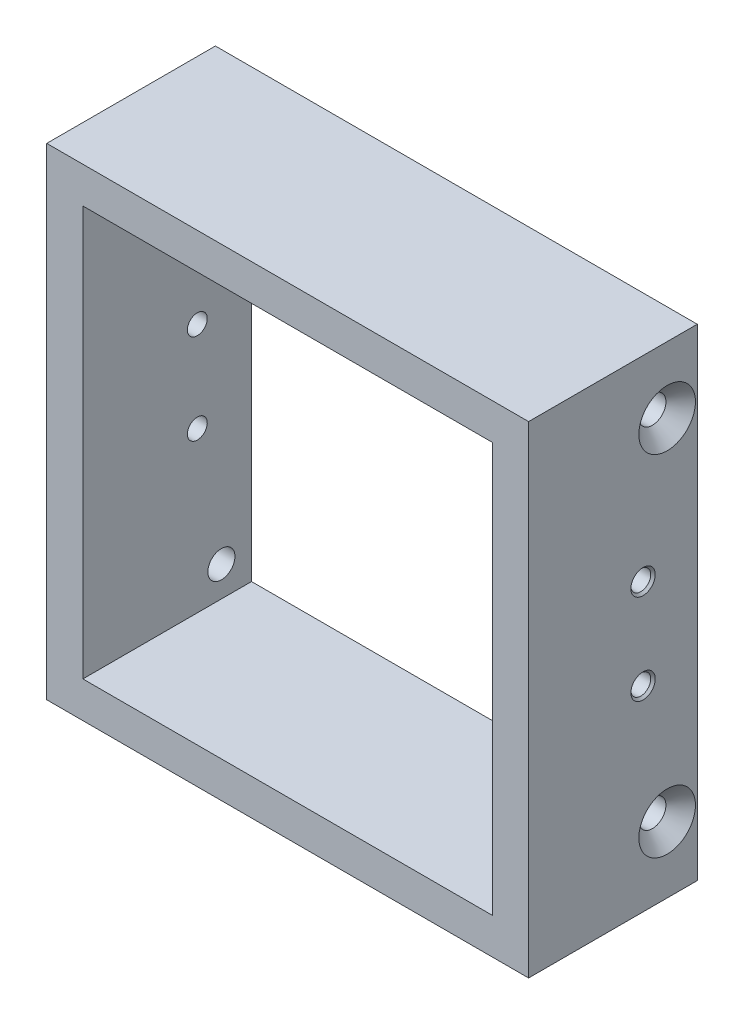
ISO-10303-21;
HEADER;
FILE_DESCRIPTION(('STEP AP214'),'2;1');
FILE_NAME('part.step','',(''),(''),'','','');
FILE_SCHEMA(('AUTOMOTIVE_DESIGN { 1 0 10303 214 1 1 1 1 }'));
ENDSEC;
DATA;
#1=APPLICATION_CONTEXT('core data for automotive mechanical design processes');
#2=APPLICATION_PROTOCOL_DEFINITION('international standard','automotive_design',2000,#1);
#3=PRODUCT_CONTEXT('',#1,'mechanical');
#4=PRODUCT('Part','Part','',(#3));
#5=PRODUCT_RELATED_PRODUCT_CATEGORY('part','',(#4));
#6=PRODUCT_DEFINITION_FORMATION('','',#4);
#7=PRODUCT_DEFINITION_CONTEXT('part definition',#1,'design');
#8=PRODUCT_DEFINITION('design','',#6,#7);
#9=PRODUCT_DEFINITION_SHAPE('','',#8);
#10=(LENGTH_UNIT() NAMED_UNIT(*) SI_UNIT(.MILLI.,.METRE.));
#11=(NAMED_UNIT(*) PLANE_ANGLE_UNIT() SI_UNIT($,.RADIAN.));
#12=(NAMED_UNIT(*) SI_UNIT($,.STERADIAN.) SOLID_ANGLE_UNIT());
#13=UNCERTAINTY_MEASURE_WITH_UNIT(LENGTH_MEASURE(1.E-05),#10,'distance_accuracy_value','');
#14=(GEOMETRIC_REPRESENTATION_CONTEXT(3) GLOBAL_UNCERTAINTY_ASSIGNED_CONTEXT((#13)) GLOBAL_UNIT_ASSIGNED_CONTEXT((#10,
#11,#12)) REPRESENTATION_CONTEXT('',''));
#15=CARTESIAN_POINT('',(0.,0.,0.));
#16=DIRECTION('',(0.,0.,1.));
#17=DIRECTION('',(1.,0.,0.));
#18=AXIS2_PLACEMENT_3D('',#15,#16,#17);
#19=CARTESIAN_POINT('',(40.,40.,28.));
#20=DIRECTION('',(-1.,0.,0.));
#21=DIRECTION('',(0.,0.,1.));
#22=AXIS2_PLACEMENT_3D('',#19,#20,#21);
#23=PLANE('',#22);
#24=CARTESIAN_POINT('',(40.,7.5,9.00000000000001));
#25=DIRECTION('',(1.,0.,0.));
#26=DIRECTION('',(0.,0.,-1.));
#27=AXIS2_PLACEMENT_3D('',#24,#25,#26);
#28=CIRCLE('',#27,2.025);
#29=CARTESIAN_POINT('',(40.,7.5,6.97500000000001));
#30=VERTEX_POINT('',#29);
#31=EDGE_CURVE('E202',#30,#30,#28,.T.);
#32=ORIENTED_EDGE('',*,*,#31,.F.);
#33=EDGE_LOOP('',(#32));
#34=FACE_BOUND('',#33,.T.);
#35=CARTESIAN_POINT('',(40.,-7.5,9.00000000000001));
#36=DIRECTION('',(1.,0.,0.));
#37=DIRECTION('',(0.,0.,-1.));
#38=AXIS2_PLACEMENT_3D('',#35,#36,#37);
#39=CIRCLE('',#38,2.025);
#40=CARTESIAN_POINT('',(40.,-7.5,6.975));
#41=VERTEX_POINT('',#40);
#42=EDGE_CURVE('E205',#41,#41,#39,.T.);
#43=ORIENTED_EDGE('',*,*,#42,.F.);
#44=EDGE_LOOP('',(#43));
#45=FACE_BOUND('',#44,.T.);
#46=DIRECTION('',(0.,1.,0.));
#47=VECTOR('',#46,1.);
#48=CARTESIAN_POINT('',(40.,40.,0.));
#49=LINE('',#48,#47);
#50=CARTESIAN_POINT('',(40.,-40.,0.));
#51=VERTEX_POINT('',#50);
#52=CARTESIAN_POINT('',(40.,40.,0.));
#53=VERTEX_POINT('',#52);
#54=EDGE_CURVE('E116',#51,#53,#49,.T.);
#55=ORIENTED_EDGE('',*,*,#54,.T.);
#56=DIRECTION('',(0.,0.,-1.));
#57=VECTOR('',#56,1.);
#58=CARTESIAN_POINT('',(40.,40.,28.));
#59=LINE('',#58,#57);
#60=CARTESIAN_POINT('',(40.,40.,28.));
#61=VERTEX_POINT('',#60);
#62=EDGE_CURVE('E11',#61,#53,#59,.T.);
#63=ORIENTED_EDGE('',*,*,#62,.F.);
#64=DIRECTION('',(0.,1.,0.));
#65=VECTOR('',#64,1.);
#66=CARTESIAN_POINT('',(40.,40.,28.));
#67=LINE('',#66,#65);
#68=CARTESIAN_POINT('',(40.,-40.,28.));
#69=VERTEX_POINT('',#68);
#70=EDGE_CURVE('E139',#69,#61,#67,.T.);
#71=ORIENTED_EDGE('',*,*,#70,.F.);
#72=DIRECTION('',(0.,0.,-1.));
#73=VECTOR('',#72,1.);
#74=CARTESIAN_POINT('',(40.,-40.,28.));
#75=LINE('',#74,#73);
#76=EDGE_CURVE('E149',#69,#51,#75,.T.);
#77=ORIENTED_EDGE('',*,*,#76,.T.);
#78=EDGE_LOOP('',(#55,#63,#71,#77));
#79=FACE_BOUND('',#78,.T.);
#80=CARTESIAN_POINT('',(40.,-29.,5.));
#81=DIRECTION('',(1.,0.,0.));
#82=DIRECTION('',(0.,0.,-1.));
#83=AXIS2_PLACEMENT_3D('',#80,#81,#82);
#84=CIRCLE('',#83,4.7);
#85=CARTESIAN_POINT('',(40.,-29.,0.300000000000001));
#86=VERTEX_POINT('',#85);
#87=EDGE_CURVE('E247',#86,#86,#84,.T.);
#88=ORIENTED_EDGE('',*,*,#87,.F.);
#89=EDGE_LOOP('',(#88));
#90=FACE_BOUND('',#89,.T.);
#91=CARTESIAN_POINT('',(40.,29.,5.));
#92=DIRECTION('',(1.,0.,0.));
#93=DIRECTION('',(0.,0.,-1.));
#94=AXIS2_PLACEMENT_3D('',#91,#92,#93);
#95=CIRCLE('',#94,4.7);
#96=CARTESIAN_POINT('',(40.,29.,0.299999999999997));
#97=VERTEX_POINT('',#96);
#98=EDGE_CURVE('E238',#97,#97,#95,.T.);
#99=ORIENTED_EDGE('',*,*,#98,.F.);
#100=EDGE_LOOP('',(#99));
#101=FACE_BOUND('',#100,.T.);
#102=ADVANCED_FACE('F36',(#34,#45,#79,#90,#101),#23,.F.);
#103=CARTESIAN_POINT('',(-40.,40.,28.));
#104=DIRECTION('',(1.,0.,0.));
#105=DIRECTION('',(0.,1.,0.));
#106=AXIS2_PLACEMENT_3D('',#103,#104,#105);
#107=PLANE('',#106);
#108=CARTESIAN_POINT('',(-40.,7.5,9.00000000000001));
#109=DIRECTION('',(-1.,0.,0.));
#110=DIRECTION('',(0.,0.,1.));
#111=AXIS2_PLACEMENT_3D('',#108,#109,#110);
#112=CIRCLE('',#111,2.025);
#113=CARTESIAN_POINT('',(-40.,7.5,11.025));
#114=VERTEX_POINT('',#113);
#115=EDGE_CURVE('E220',#114,#114,#112,.T.);
#116=ORIENTED_EDGE('',*,*,#115,.F.);
#117=EDGE_LOOP('',(#116));
#118=FACE_BOUND('',#117,.T.);
#119=CARTESIAN_POINT('',(-40.,-7.5,9.00000000000001));
#120=DIRECTION('',(-1.,0.,0.));
#121=DIRECTION('',(0.,0.,1.));
#122=AXIS2_PLACEMENT_3D('',#119,#120,#121);
#123=CIRCLE('',#122,2.025);
#124=CARTESIAN_POINT('',(-40.,-7.5,11.025));
#125=VERTEX_POINT('',#124);
#126=EDGE_CURVE('E229',#125,#125,#123,.T.);
#127=ORIENTED_EDGE('',*,*,#126,.F.);
#128=EDGE_LOOP('',(#127));
#129=FACE_BOUND('',#128,.T.);
#130=CARTESIAN_POINT('',(-40.,29.,5.));
#131=DIRECTION('',(-1.,0.,0.));
#132=DIRECTION('',(0.,0.,1.));
#133=AXIS2_PLACEMENT_3D('',#130,#131,#132);
#134=CIRCLE('',#133,4.7);
#135=CARTESIAN_POINT('',(-40.,29.,9.7));
#136=VERTEX_POINT('',#135);
#137=EDGE_CURVE('E265',#136,#136,#134,.T.);
#138=ORIENTED_EDGE('',*,*,#137,.F.);
#139=EDGE_LOOP('',(#138));
#140=FACE_BOUND('',#139,.T.);
#141=DIRECTION('',(0.,-1.,0.));
#142=VECTOR('',#141,1.);
#143=CARTESIAN_POINT('',(-40.,40.,0.));
#144=LINE('',#143,#142);
#145=CARTESIAN_POINT('',(-40.,40.,0.));
#146=VERTEX_POINT('',#145);
#147=CARTESIAN_POINT('',(-40.,-40.,0.));
#148=VERTEX_POINT('',#147);
#149=EDGE_CURVE('E154',#146,#148,#144,.T.);
#150=ORIENTED_EDGE('',*,*,#149,.T.);
#151=DIRECTION('',(0.,0.,-1.));
#152=VECTOR('',#151,1.);
#153=CARTESIAN_POINT('',(-40.,-40.,28.));
#154=LINE('',#153,#152);
#155=CARTESIAN_POINT('',(-40.,-40.,28.));
#156=VERTEX_POINT('',#155);
#157=EDGE_CURVE('E159',#156,#148,#154,.T.);
#158=ORIENTED_EDGE('',*,*,#157,.F.);
#159=DIRECTION('',(0.,-1.,0.));
#160=VECTOR('',#159,1.);
#161=CARTESIAN_POINT('',(-40.,40.,28.));
#162=LINE('',#161,#160);
#163=CARTESIAN_POINT('',(-40.,40.,28.));
#164=VERTEX_POINT('',#163);
#165=EDGE_CURVE('E145',#164,#156,#162,.T.);
#166=ORIENTED_EDGE('',*,*,#165,.F.);
#167=DIRECTION('',(0.,0.,-1.));
#168=VECTOR('',#167,1.);
#169=CARTESIAN_POINT('',(-40.,40.,28.));
#170=LINE('',#169,#168);
#171=EDGE_CURVE('E43',#164,#146,#170,.T.);
#172=ORIENTED_EDGE('',*,*,#171,.T.);
#173=EDGE_LOOP('',(#150,#158,#166,#172));
#174=FACE_BOUND('',#173,.T.);
#175=CARTESIAN_POINT('',(-40.,-29.,5.));
#176=DIRECTION('',(-1.,0.,0.));
#177=DIRECTION('',(0.,0.,1.));
#178=AXIS2_PLACEMENT_3D('',#175,#176,#177);
#179=CIRCLE('',#178,4.7);
#180=CARTESIAN_POINT('',(-40.,-29.,9.7));
#181=VERTEX_POINT('',#180);
#182=EDGE_CURVE('E256',#181,#181,#179,.T.);
#183=ORIENTED_EDGE('',*,*,#182,.F.);
#184=EDGE_LOOP('',(#183));
#185=FACE_BOUND('',#184,.T.);
#186=ADVANCED_FACE('F166',(#118,#129,#140,#174,#185),#107,.F.);
#187=CARTESIAN_POINT('',(0.,0.,28.));
#188=DIRECTION('',(0.,0.,1.));
#189=DIRECTION('',(1.,0.,0.));
#190=AXIS2_PLACEMENT_3D('',#187,#188,#189);
#191=PLANE('',#190);
#192=ORIENTED_EDGE('',*,*,#70,.T.);
#193=DIRECTION('',(-1.,0.,0.));
#194=VECTOR('',#193,1.);
#195=CARTESIAN_POINT('',(-40.,40.,28.));
#196=LINE('',#195,#194);
#197=EDGE_CURVE('E142',#61,#164,#196,.T.);
#198=ORIENTED_EDGE('',*,*,#197,.T.);
#199=ORIENTED_EDGE('',*,*,#165,.T.);
#200=DIRECTION('',(1.,0.,0.));
#201=VECTOR('',#200,1.);
#202=CARTESIAN_POINT('',(-40.,-40.,28.));
#203=LINE('',#202,#201);
#204=EDGE_CURVE('E147',#156,#69,#203,.T.);
#205=ORIENTED_EDGE('',*,*,#204,.T.);
#206=EDGE_LOOP('',(#192,#198,#199,#205));
#207=FACE_BOUND('',#206,.T.);
#208=DIRECTION('',(-1.,0.,0.));
#209=VECTOR('',#208,1.);
#210=CARTESIAN_POINT('',(-34.,34.,28.));
#211=LINE('',#210,#209);
#212=CARTESIAN_POINT('',(34.,34.,28.));
#213=VERTEX_POINT('',#212);
#214=CARTESIAN_POINT('',(-34.,34.,28.));
#215=VERTEX_POINT('',#214);
#216=EDGE_CURVE('E108',#213,#215,#211,.T.);
#217=ORIENTED_EDGE('',*,*,#216,.F.);
#218=DIRECTION('',(0.,1.,0.));
#219=VECTOR('',#218,1.);
#220=CARTESIAN_POINT('',(34.,34.,28.));
#221=LINE('',#220,#219);
#222=CARTESIAN_POINT('',(34.,-34.,28.));
#223=VERTEX_POINT('',#222);
#224=EDGE_CURVE('E100',#223,#213,#221,.T.);
#225=ORIENTED_EDGE('',*,*,#224,.F.);
#226=DIRECTION('',(1.,0.,0.));
#227=VECTOR('',#226,1.);
#228=CARTESIAN_POINT('',(-34.,-34.,28.));
#229=LINE('',#228,#227);
#230=CARTESIAN_POINT('',(-34.,-34.,28.));
#231=VERTEX_POINT('',#230);
#232=EDGE_CURVE('E123',#231,#223,#229,.T.);
#233=ORIENTED_EDGE('',*,*,#232,.F.);
#234=DIRECTION('',(0.,-1.,0.));
#235=VECTOR('',#234,1.);
#236=CARTESIAN_POINT('',(-34.,34.,28.));
#237=LINE('',#236,#235);
#238=EDGE_CURVE('E121',#215,#231,#237,.T.);
#239=ORIENTED_EDGE('',*,*,#238,.F.);
#240=EDGE_LOOP('',(#217,#225,#233,#239));
#241=FACE_BOUND('',#240,.T.);
#242=ADVANCED_FACE('F120',(#207,#241),#191,.T.);
#243=CARTESIAN_POINT('',(0.,0.,0.));
#244=DIRECTION('',(0.,0.,1.));
#245=DIRECTION('',(1.,0.,0.));
#246=AXIS2_PLACEMENT_3D('',#243,#244,#245);
#247=PLANE('',#246);
#248=ORIENTED_EDGE('',*,*,#54,.F.);
#249=DIRECTION('',(1.,0.,0.));
#250=VECTOR('',#249,1.);
#251=CARTESIAN_POINT('',(-40.,-40.,0.));
#252=LINE('',#251,#250);
#253=EDGE_CURVE('E143',#148,#51,#252,.T.);
#254=ORIENTED_EDGE('',*,*,#253,.F.);
#255=ORIENTED_EDGE('',*,*,#149,.F.);
#256=DIRECTION('',(-1.,0.,0.));
#257=VECTOR('',#256,1.);
#258=CARTESIAN_POINT('',(-40.,40.,0.));
#259=LINE('',#258,#257);
#260=EDGE_CURVE('E152',#53,#146,#259,.T.);
#261=ORIENTED_EDGE('',*,*,#260,.F.);
#262=EDGE_LOOP('',(#248,#254,#255,#261));
#263=FACE_BOUND('',#262,.T.);
#264=DIRECTION('',(0.,1.,0.));
#265=VECTOR('',#264,1.);
#266=CARTESIAN_POINT('',(34.,34.,0.));
#267=LINE('',#266,#265);
#268=CARTESIAN_POINT('',(34.,-34.,0.));
#269=VERTEX_POINT('',#268);
#270=CARTESIAN_POINT('',(34.,34.,0.));
#271=VERTEX_POINT('',#270);
#272=EDGE_CURVE('E58',#269,#271,#267,.T.);
#273=ORIENTED_EDGE('',*,*,#272,.T.);
#274=DIRECTION('',(-1.,0.,0.));
#275=VECTOR('',#274,1.);
#276=CARTESIAN_POINT('',(-34.,34.,0.));
#277=LINE('',#276,#275);
#278=CARTESIAN_POINT('',(-34.,34.,0.));
#279=VERTEX_POINT('',#278);
#280=EDGE_CURVE('E115',#271,#279,#277,.T.);
#281=ORIENTED_EDGE('',*,*,#280,.T.);
#282=DIRECTION('',(0.,-1.,0.));
#283=VECTOR('',#282,1.);
#284=CARTESIAN_POINT('',(-34.,34.,0.));
#285=LINE('',#284,#283);
#286=CARTESIAN_POINT('',(-34.,-34.,0.));
#287=VERTEX_POINT('',#286);
#288=EDGE_CURVE('E131',#279,#287,#285,.T.);
#289=ORIENTED_EDGE('',*,*,#288,.T.);
#290=DIRECTION('',(1.,0.,0.));
#291=VECTOR('',#290,1.);
#292=CARTESIAN_POINT('',(-34.,-34.,0.));
#293=LINE('',#292,#291);
#294=EDGE_CURVE('E109',#287,#269,#293,.T.);
#295=ORIENTED_EDGE('',*,*,#294,.T.);
#296=EDGE_LOOP('',(#273,#281,#289,#295));
#297=FACE_BOUND('',#296,.T.);
#298=ADVANCED_FACE('F173',(#263,#297),#247,.F.);
#299=CARTESIAN_POINT('',(-40.,40.,28.));
#300=DIRECTION('',(0.,-1.,0.));
#301=DIRECTION('',(0.,0.,-1.));
#302=AXIS2_PLACEMENT_3D('',#299,#300,#301);
#303=PLANE('',#302);
#304=ORIENTED_EDGE('',*,*,#260,.T.);
#305=ORIENTED_EDGE('',*,*,#171,.F.);
#306=ORIENTED_EDGE('',*,*,#197,.F.);
#307=ORIENTED_EDGE('',*,*,#62,.T.);
#308=EDGE_LOOP('',(#304,#305,#306,#307));
#309=FACE_BOUND('',#308,.T.);
#310=ADVANCED_FACE('F184',(#309),#303,.F.);
#311=CARTESIAN_POINT('',(-40.,-40.,28.));
#312=DIRECTION('',(0.,1.,0.));
#313=DIRECTION('',(0.,0.,1.));
#314=AXIS2_PLACEMENT_3D('',#311,#312,#313);
#315=PLANE('',#314);
#316=ORIENTED_EDGE('',*,*,#253,.T.);
#317=ORIENTED_EDGE('',*,*,#76,.F.);
#318=ORIENTED_EDGE('',*,*,#204,.F.);
#319=ORIENTED_EDGE('',*,*,#157,.T.);
#320=EDGE_LOOP('',(#316,#317,#318,#319));
#321=FACE_BOUND('',#320,.T.);
#322=ADVANCED_FACE('F177',(#321),#315,.F.);
#323=CARTESIAN_POINT('',(34.,34.,28.));
#324=DIRECTION('',(-1.,0.,0.));
#325=DIRECTION('',(0.,-1.,0.));
#326=AXIS2_PLACEMENT_3D('',#323,#324,#325);
#327=PLANE('',#326);
#328=CARTESIAN_POINT('',(34.,7.5,9.00000000000001));
#329=DIRECTION('',(-1.,0.,0.));
#330=DIRECTION('',(0.,-1.,0.));
#331=AXIS2_PLACEMENT_3D('',#328,#329,#330);
#332=CIRCLE('',#331,1.65);
#333=CARTESIAN_POINT('',(34.,5.85,9.00000000000001));
#334=VERTEX_POINT('',#333);
#335=EDGE_CURVE('E208',#334,#334,#332,.T.);
#336=ORIENTED_EDGE('',*,*,#335,.F.);
#337=EDGE_LOOP('',(#336));
#338=FACE_BOUND('',#337,.T.);
#339=CARTESIAN_POINT('',(34.,-7.5,9.00000000000001));
#340=DIRECTION('',(-1.,0.,0.));
#341=DIRECTION('',(0.,-1.,0.));
#342=AXIS2_PLACEMENT_3D('',#339,#340,#341);
#343=CIRCLE('',#342,1.65);
#344=CARTESIAN_POINT('',(34.,-9.15,9.00000000000001));
#345=VERTEX_POINT('',#344);
#346=EDGE_CURVE('E211',#345,#345,#343,.T.);
#347=ORIENTED_EDGE('',*,*,#346,.F.);
#348=EDGE_LOOP('',(#347));
#349=FACE_BOUND('',#348,.T.);
#350=CARTESIAN_POINT('',(34.,29.,5.));
#351=DIRECTION('',(-1.,0.,0.));
#352=DIRECTION('',(0.,-1.,0.));
#353=AXIS2_PLACEMENT_3D('',#350,#351,#352);
#354=CIRCLE('',#353,2.25);
#355=CARTESIAN_POINT('',(34.,26.75,5.));
#356=VERTEX_POINT('',#355);
#357=EDGE_CURVE('E244',#356,#356,#354,.T.);
#358=ORIENTED_EDGE('',*,*,#357,.F.);
#359=EDGE_LOOP('',(#358));
#360=FACE_BOUND('',#359,.T.);
#361=CARTESIAN_POINT('',(34.,-29.,5.));
#362=DIRECTION('',(-1.,0.,0.));
#363=DIRECTION('',(0.,-1.,0.));
#364=AXIS2_PLACEMENT_3D('',#361,#362,#363);
#365=CIRCLE('',#364,2.24999999999999);
#366=CARTESIAN_POINT('',(34.,-31.25,5.));
#367=VERTEX_POINT('',#366);
#368=EDGE_CURVE('E253',#367,#367,#365,.T.);
#369=ORIENTED_EDGE('',*,*,#368,.F.);
#370=EDGE_LOOP('',(#369));
#371=FACE_BOUND('',#370,.T.);
#372=ORIENTED_EDGE('',*,*,#272,.F.);
#373=DIRECTION('',(0.,0.,-1.));
#374=VECTOR('',#373,1.);
#375=CARTESIAN_POINT('',(34.,-34.,28.));
#376=LINE('',#375,#374);
#377=EDGE_CURVE('E104',#223,#269,#376,.T.);
#378=ORIENTED_EDGE('',*,*,#377,.F.);
#379=ORIENTED_EDGE('',*,*,#224,.T.);
#380=DIRECTION('',(0.,0.,-1.));
#381=VECTOR('',#380,1.);
#382=CARTESIAN_POINT('',(34.,34.,28.));
#383=LINE('',#382,#381);
#384=EDGE_CURVE('E103',#213,#271,#383,.T.);
#385=ORIENTED_EDGE('',*,*,#384,.T.);
#386=EDGE_LOOP('',(#372,#378,#379,#385));
#387=FACE_BOUND('',#386,.T.);
#388=ADVANCED_FACE('F102',(#338,#349,#360,#371,#387),#327,.T.);
#389=CARTESIAN_POINT('',(-34.,34.,28.));
#390=DIRECTION('',(0.,-1.,0.));
#391=DIRECTION('',(0.,0.,-1.));
#392=AXIS2_PLACEMENT_3D('',#389,#390,#391);
#393=PLANE('',#392);
#394=ORIENTED_EDGE('',*,*,#280,.F.);
#395=ORIENTED_EDGE('',*,*,#384,.F.);
#396=ORIENTED_EDGE('',*,*,#216,.T.);
#397=DIRECTION('',(0.,0.,-1.));
#398=VECTOR('',#397,1.);
#399=CARTESIAN_POINT('',(-34.,34.,28.));
#400=LINE('',#399,#398);
#401=EDGE_CURVE('E117',#215,#279,#400,.T.);
#402=ORIENTED_EDGE('',*,*,#401,.T.);
#403=EDGE_LOOP('',(#394,#395,#396,#402));
#404=FACE_BOUND('',#403,.T.);
#405=ADVANCED_FACE('F112',(#404),#393,.T.);
#406=CARTESIAN_POINT('',(-34.,34.,28.));
#407=DIRECTION('',(1.,0.,0.));
#408=DIRECTION('',(0.,1.,0.));
#409=AXIS2_PLACEMENT_3D('',#406,#407,#408);
#410=PLANE('',#409);
#411=CARTESIAN_POINT('',(-34.,7.5,9.00000000000001));
#412=DIRECTION('',(1.,0.,0.));
#413=DIRECTION('',(0.,1.,0.));
#414=AXIS2_PLACEMENT_3D('',#411,#412,#413);
#415=CIRCLE('',#414,1.64999999999999);
#416=CARTESIAN_POINT('',(-34.,9.14999999999999,9.00000000000001));
#417=VERTEX_POINT('',#416);
#418=EDGE_CURVE('E226',#417,#417,#415,.T.);
#419=ORIENTED_EDGE('',*,*,#418,.F.);
#420=EDGE_LOOP('',(#419));
#421=FACE_BOUND('',#420,.T.);
#422=CARTESIAN_POINT('',(-34.,-7.5,9.00000000000001));
#423=DIRECTION('',(1.,0.,0.));
#424=DIRECTION('',(0.,1.,0.));
#425=AXIS2_PLACEMENT_3D('',#422,#423,#424);
#426=CIRCLE('',#425,1.64999999999999);
#427=CARTESIAN_POINT('',(-34.,-5.85000000000001,9.00000000000001));
#428=VERTEX_POINT('',#427);
#429=EDGE_CURVE('E235',#428,#428,#426,.T.);
#430=ORIENTED_EDGE('',*,*,#429,.F.);
#431=EDGE_LOOP('',(#430));
#432=FACE_BOUND('',#431,.T.);
#433=CARTESIAN_POINT('',(-34.,-29.,5.));
#434=DIRECTION('',(1.,0.,0.));
#435=DIRECTION('',(0.,1.,0.));
#436=AXIS2_PLACEMENT_3D('',#433,#434,#435);
#437=CIRCLE('',#436,2.24999999999999);
#438=CARTESIAN_POINT('',(-34.,-26.75,5.));
#439=VERTEX_POINT('',#438);
#440=EDGE_CURVE('E262',#439,#439,#437,.T.);
#441=ORIENTED_EDGE('',*,*,#440,.F.);
#442=EDGE_LOOP('',(#441));
#443=FACE_BOUND('',#442,.T.);
#444=CARTESIAN_POINT('',(-34.,29.,5.));
#445=DIRECTION('',(1.,0.,0.));
#446=DIRECTION('',(0.,1.,0.));
#447=AXIS2_PLACEMENT_3D('',#444,#445,#446);
#448=CIRCLE('',#447,2.25);
#449=CARTESIAN_POINT('',(-34.,31.25,5.));
#450=VERTEX_POINT('',#449);
#451=EDGE_CURVE('E129',#450,#450,#448,.T.);
#452=ORIENTED_EDGE('',*,*,#451,.F.);
#453=EDGE_LOOP('',(#452));
#454=FACE_BOUND('',#453,.T.);
#455=ORIENTED_EDGE('',*,*,#288,.F.);
#456=ORIENTED_EDGE('',*,*,#401,.F.);
#457=ORIENTED_EDGE('',*,*,#238,.T.);
#458=DIRECTION('',(0.,0.,-1.));
#459=VECTOR('',#458,1.);
#460=CARTESIAN_POINT('',(-34.,-34.,28.));
#461=LINE('',#460,#459);
#462=EDGE_CURVE('E50',#231,#287,#461,.T.);
#463=ORIENTED_EDGE('',*,*,#462,.T.);
#464=EDGE_LOOP('',(#455,#456,#457,#463));
#465=FACE_BOUND('',#464,.T.);
#466=ADVANCED_FACE('F275',(#421,#432,#443,#454,#465),#410,.T.);
#467=CARTESIAN_POINT('',(-34.,-34.,28.));
#468=DIRECTION('',(0.,1.,0.));
#469=DIRECTION('',(0.,0.,1.));
#470=AXIS2_PLACEMENT_3D('',#467,#468,#469);
#471=PLANE('',#470);
#472=ORIENTED_EDGE('',*,*,#294,.F.);
#473=ORIENTED_EDGE('',*,*,#462,.F.);
#474=ORIENTED_EDGE('',*,*,#232,.T.);
#475=ORIENTED_EDGE('',*,*,#377,.T.);
#476=EDGE_LOOP('',(#472,#473,#474,#475));
#477=FACE_BOUND('',#476,.T.);
#478=ADVANCED_FACE('F278',(#477),#471,.T.);
#479=CARTESIAN_POINT('',(-40.,29.,5.));
#480=DIRECTION('',(-1.,0.,0.));
#481=DIRECTION('',(0.,0.,1.));
#482=AXIS2_PLACEMENT_3D('',#479,#480,#481);
#483=CYLINDRICAL_SURFACE('',#482,2.25);
#484=CARTESIAN_POINT('',(-37.55,29.,5.));
#485=DIRECTION('',(-1.,0.,0.));
#486=DIRECTION('',(0.,0.,1.));
#487=AXIS2_PLACEMENT_3D('',#484,#485,#486);
#488=CIRCLE('',#487,2.25);
#489=CARTESIAN_POINT('',(-37.55,29.,7.25));
#490=VERTEX_POINT('',#489);
#491=EDGE_CURVE('E268',#490,#490,#488,.T.);
#492=ORIENTED_EDGE('',*,*,#491,.T.);
#493=EDGE_LOOP('',(#492));
#494=FACE_BOUND('',#493,.T.);
#495=ORIENTED_EDGE('',*,*,#451,.T.);
#496=EDGE_LOOP('',(#495));
#497=FACE_BOUND('',#496,.T.);
#498=ADVANCED_FACE('F273',(#494,#497),#483,.F.);
#499=CARTESIAN_POINT('',(-40.,29.,5.));
#500=DIRECTION('',(-1.,0.,0.));
#501=DIRECTION('',(0.,0.,1.));
#502=AXIS2_PLACEMENT_3D('',#499,#500,#501);
#503=CONICAL_SURFACE('',#502,4.7,0.785398163397448);
#504=ORIENTED_EDGE('',*,*,#491,.F.);
#505=EDGE_LOOP('',(#504));
#506=FACE_BOUND('',#505,.T.);
#507=ORIENTED_EDGE('',*,*,#137,.T.);
#508=EDGE_LOOP('',(#507));
#509=FACE_BOUND('',#508,.T.);
#510=ADVANCED_FACE('F287',(#506,#509),#503,.F.);
#511=CARTESIAN_POINT('',(-40.,-29.,5.));
#512=DIRECTION('',(-1.,0.,0.));
#513=DIRECTION('',(0.,0.,1.));
#514=AXIS2_PLACEMENT_3D('',#511,#512,#513);
#515=CYLINDRICAL_SURFACE('',#514,2.24999999999999);
#516=CARTESIAN_POINT('',(-37.55,-29.,5.));
#517=DIRECTION('',(-1.,0.,0.));
#518=DIRECTION('',(0.,0.,1.));
#519=AXIS2_PLACEMENT_3D('',#516,#517,#518);
#520=CIRCLE('',#519,2.25);
#521=CARTESIAN_POINT('',(-37.55,-29.,7.25));
#522=VERTEX_POINT('',#521);
#523=EDGE_CURVE('E259',#522,#522,#520,.T.);
#524=ORIENTED_EDGE('',*,*,#523,.T.);
#525=EDGE_LOOP('',(#524));
#526=FACE_BOUND('',#525,.T.);
#527=ORIENTED_EDGE('',*,*,#440,.T.);
#528=EDGE_LOOP('',(#527));
#529=FACE_BOUND('',#528,.T.);
#530=ADVANCED_FACE('F343',(#526,#529),#515,.F.);
#531=CARTESIAN_POINT('',(-40.,-29.,5.));
#532=DIRECTION('',(-1.,0.,0.));
#533=DIRECTION('',(0.,0.,1.));
#534=AXIS2_PLACEMENT_3D('',#531,#532,#533);
#535=CONICAL_SURFACE('',#534,4.7,0.785398163397448);
#536=ORIENTED_EDGE('',*,*,#523,.F.);
#537=EDGE_LOOP('',(#536));
#538=FACE_BOUND('',#537,.T.);
#539=ORIENTED_EDGE('',*,*,#182,.T.);
#540=EDGE_LOOP('',(#539));
#541=FACE_BOUND('',#540,.T.);
#542=ADVANCED_FACE('F353',(#538,#541),#535,.F.);
#543=CARTESIAN_POINT('',(40.,-29.,5.));
#544=DIRECTION('',(1.,0.,0.));
#545=DIRECTION('',(0.,0.,-1.));
#546=AXIS2_PLACEMENT_3D('',#543,#544,#545);
#547=CYLINDRICAL_SURFACE('',#546,2.24999999999999);
#548=CARTESIAN_POINT('',(37.55,-29.,5.));
#549=DIRECTION('',(1.,0.,0.));
#550=DIRECTION('',(0.,0.,-1.));
#551=AXIS2_PLACEMENT_3D('',#548,#549,#550);
#552=CIRCLE('',#551,2.25);
#553=CARTESIAN_POINT('',(37.55,-29.,2.75));
#554=VERTEX_POINT('',#553);
#555=EDGE_CURVE('E250',#554,#554,#552,.T.);
#556=ORIENTED_EDGE('',*,*,#555,.T.);
#557=EDGE_LOOP('',(#556));
#558=FACE_BOUND('',#557,.T.);
#559=ORIENTED_EDGE('',*,*,#368,.T.);
#560=EDGE_LOOP('',(#559));
#561=FACE_BOUND('',#560,.T.);
#562=ADVANCED_FACE('F363',(#558,#561),#547,.F.);
#563=CARTESIAN_POINT('',(40.,-29.,5.));
#564=DIRECTION('',(1.,0.,0.));
#565=DIRECTION('',(0.,0.,-1.));
#566=AXIS2_PLACEMENT_3D('',#563,#564,#565);
#567=CONICAL_SURFACE('',#566,4.7,0.785398163397448);
#568=ORIENTED_EDGE('',*,*,#555,.F.);
#569=EDGE_LOOP('',(#568));
#570=FACE_BOUND('',#569,.T.);
#571=ORIENTED_EDGE('',*,*,#87,.T.);
#572=EDGE_LOOP('',(#571));
#573=FACE_BOUND('',#572,.T.);
#574=ADVANCED_FACE('F374',(#570,#573),#567,.F.);
#575=CARTESIAN_POINT('',(40.,29.,5.));
#576=DIRECTION('',(1.,0.,0.));
#577=DIRECTION('',(0.,0.,-1.));
#578=AXIS2_PLACEMENT_3D('',#575,#576,#577);
#579=CYLINDRICAL_SURFACE('',#578,2.25);
#580=CARTESIAN_POINT('',(37.55,29.,5.));
#581=DIRECTION('',(1.,0.,0.));
#582=DIRECTION('',(0.,0.,-1.));
#583=AXIS2_PLACEMENT_3D('',#580,#581,#582);
#584=CIRCLE('',#583,2.25);
#585=CARTESIAN_POINT('',(37.55,29.,2.75));
#586=VERTEX_POINT('',#585);
#587=EDGE_CURVE('E241',#586,#586,#584,.T.);
#588=ORIENTED_EDGE('',*,*,#587,.T.);
#589=EDGE_LOOP('',(#588));
#590=FACE_BOUND('',#589,.T.);
#591=ORIENTED_EDGE('',*,*,#357,.T.);
#592=EDGE_LOOP('',(#591));
#593=FACE_BOUND('',#592,.T.);
#594=ADVANCED_FACE('F384',(#590,#593),#579,.F.);
#595=CARTESIAN_POINT('',(40.,29.,5.));
#596=DIRECTION('',(1.,0.,0.));
#597=DIRECTION('',(0.,0.,-1.));
#598=AXIS2_PLACEMENT_3D('',#595,#596,#597);
#599=CONICAL_SURFACE('',#598,4.7,0.785398163397448);
#600=ORIENTED_EDGE('',*,*,#587,.F.);
#601=EDGE_LOOP('',(#600));
#602=FACE_BOUND('',#601,.T.);
#603=ORIENTED_EDGE('',*,*,#98,.T.);
#604=EDGE_LOOP('',(#603));
#605=FACE_BOUND('',#604,.T.);
#606=ADVANCED_FACE('F394',(#602,#605),#599,.F.);
#607=CARTESIAN_POINT('',(-40.,-7.5,9.00000000000001));
#608=DIRECTION('',(-1.,0.,0.));
#609=DIRECTION('',(0.,0.,1.));
#610=AXIS2_PLACEMENT_3D('',#607,#608,#609);
#611=CYLINDRICAL_SURFACE('',#610,1.64999999999999);
#612=CARTESIAN_POINT('',(-39.625,-7.5,9.00000000000001));
#613=DIRECTION('',(-1.,0.,0.));
#614=DIRECTION('',(0.,0.,1.));
#615=AXIS2_PLACEMENT_3D('',#612,#613,#614);
#616=CIRCLE('',#615,1.65);
#617=CARTESIAN_POINT('',(-39.625,-7.5,10.65));
#618=VERTEX_POINT('',#617);
#619=EDGE_CURVE('E232',#618,#618,#616,.T.);
#620=ORIENTED_EDGE('',*,*,#619,.T.);
#621=EDGE_LOOP('',(#620));
#622=FACE_BOUND('',#621,.T.);
#623=ORIENTED_EDGE('',*,*,#429,.T.);
#624=EDGE_LOOP('',(#623));
#625=FACE_BOUND('',#624,.T.);
#626=ADVANCED_FACE('F403',(#622,#625),#611,.F.);
#627=CARTESIAN_POINT('',(-40.,-7.5,9.00000000000001));
#628=DIRECTION('',(-1.,0.,0.));
#629=DIRECTION('',(0.,0.,1.));
#630=AXIS2_PLACEMENT_3D('',#627,#628,#629);
#631=CONICAL_SURFACE('',#630,2.025,0.78539816339745);
#632=ORIENTED_EDGE('',*,*,#619,.F.);
#633=EDGE_LOOP('',(#632));
#634=FACE_BOUND('',#633,.T.);
#635=ORIENTED_EDGE('',*,*,#126,.T.);
#636=EDGE_LOOP('',(#635));
#637=FACE_BOUND('',#636,.T.);
#638=ADVANCED_FACE('F423',(#634,#637),#631,.F.);
#639=CARTESIAN_POINT('',(-40.,7.5,9.00000000000001));
#640=DIRECTION('',(-1.,0.,0.));
#641=DIRECTION('',(0.,0.,1.));
#642=AXIS2_PLACEMENT_3D('',#639,#640,#641);
#643=CYLINDRICAL_SURFACE('',#642,1.64999999999999);
#644=CARTESIAN_POINT('',(-39.625,7.5,9.00000000000001));
#645=DIRECTION('',(-1.,0.,0.));
#646=DIRECTION('',(0.,0.,1.));
#647=AXIS2_PLACEMENT_3D('',#644,#645,#646);
#648=CIRCLE('',#647,1.65);
#649=CARTESIAN_POINT('',(-39.625,7.5,10.65));
#650=VERTEX_POINT('',#649);
#651=EDGE_CURVE('E223',#650,#650,#648,.T.);
#652=ORIENTED_EDGE('',*,*,#651,.T.);
#653=EDGE_LOOP('',(#652));
#654=FACE_BOUND('',#653,.T.);
#655=ORIENTED_EDGE('',*,*,#418,.T.);
#656=EDGE_LOOP('',(#655));
#657=FACE_BOUND('',#656,.T.);
#658=ADVANCED_FACE('F436',(#654,#657),#643,.F.);
#659=CARTESIAN_POINT('',(-40.,7.5,9.00000000000001));
#660=DIRECTION('',(-1.,0.,0.));
#661=DIRECTION('',(0.,0.,1.));
#662=AXIS2_PLACEMENT_3D('',#659,#660,#661);
#663=CONICAL_SURFACE('',#662,2.025,0.785398163397448);
#664=ORIENTED_EDGE('',*,*,#651,.F.);
#665=EDGE_LOOP('',(#664));
#666=FACE_BOUND('',#665,.T.);
#667=ORIENTED_EDGE('',*,*,#115,.T.);
#668=EDGE_LOOP('',(#667));
#669=FACE_BOUND('',#668,.T.);
#670=ADVANCED_FACE('F447',(#666,#669),#663,.F.);
#671=CARTESIAN_POINT('',(40.,-7.5,9.00000000000001));
#672=DIRECTION('',(1.,0.,0.));
#673=DIRECTION('',(0.,0.,-1.));
#674=AXIS2_PLACEMENT_3D('',#671,#672,#673);
#675=CYLINDRICAL_SURFACE('',#674,1.65);
#676=CARTESIAN_POINT('',(39.625,-7.5,9.00000000000001));
#677=DIRECTION('',(1.,0.,0.));
#678=DIRECTION('',(0.,0.,-1.));
#679=AXIS2_PLACEMENT_3D('',#676,#677,#678);
#680=CIRCLE('',#679,1.65);
#681=CARTESIAN_POINT('',(39.625,-7.5,7.35000000000001));
#682=VERTEX_POINT('',#681);
#683=EDGE_CURVE('E207',#682,#682,#680,.T.);
#684=ORIENTED_EDGE('',*,*,#683,.T.);
#685=EDGE_LOOP('',(#684));
#686=FACE_BOUND('',#685,.T.);
#687=ORIENTED_EDGE('',*,*,#346,.T.);
#688=EDGE_LOOP('',(#687));
#689=FACE_BOUND('',#688,.T.);
#690=ADVANCED_FACE('F458',(#686,#689),#675,.F.);
#691=CARTESIAN_POINT('',(40.,-7.5,9.00000000000001));
#692=DIRECTION('',(1.,0.,0.));
#693=DIRECTION('',(0.,0.,-1.));
#694=AXIS2_PLACEMENT_3D('',#691,#692,#693);
#695=CONICAL_SURFACE('',#694,2.025,0.78539816339745);
#696=ORIENTED_EDGE('',*,*,#683,.F.);
#697=EDGE_LOOP('',(#696));
#698=FACE_BOUND('',#697,.T.);
#699=ORIENTED_EDGE('',*,*,#42,.T.);
#700=EDGE_LOOP('',(#699));
#701=FACE_BOUND('',#700,.T.);
#702=ADVANCED_FACE('F479',(#698,#701),#695,.F.);
#703=CARTESIAN_POINT('',(40.,7.5,9.00000000000001));
#704=DIRECTION('',(1.,0.,0.));
#705=DIRECTION('',(0.,0.,-1.));
#706=AXIS2_PLACEMENT_3D('',#703,#704,#705);
#707=CYLINDRICAL_SURFACE('',#706,1.65);
#708=CARTESIAN_POINT('',(39.625,7.5,9.00000000000001));
#709=DIRECTION('',(1.,0.,0.));
#710=DIRECTION('',(0.,0.,-1.));
#711=AXIS2_PLACEMENT_3D('',#708,#709,#710);
#712=CIRCLE('',#711,1.65);
#713=CARTESIAN_POINT('',(39.625,7.5,7.35000000000001));
#714=VERTEX_POINT('',#713);
#715=EDGE_CURVE('E214',#714,#714,#712,.T.);
#716=ORIENTED_EDGE('',*,*,#715,.T.);
#717=EDGE_LOOP('',(#716));
#718=FACE_BOUND('',#717,.T.);
#719=ORIENTED_EDGE('',*,*,#335,.T.);
#720=EDGE_LOOP('',(#719));
#721=FACE_BOUND('',#720,.T.);
#722=ADVANCED_FACE('F491',(#718,#721),#707,.F.);
#723=CARTESIAN_POINT('',(40.,7.5,9.00000000000001));
#724=DIRECTION('',(1.,0.,0.));
#725=DIRECTION('',(0.,0.,-1.));
#726=AXIS2_PLACEMENT_3D('',#723,#724,#725);
#727=CONICAL_SURFACE('',#726,2.025,0.785398163397448);
#728=ORIENTED_EDGE('',*,*,#715,.F.);
#729=EDGE_LOOP('',(#728));
#730=FACE_BOUND('',#729,.T.);
#731=ORIENTED_EDGE('',*,*,#31,.T.);
#732=EDGE_LOOP('',(#731));
#733=FACE_BOUND('',#732,.T.);
#734=ADVANCED_FACE('F502',(#730,#733),#727,.F.);
#735=CLOSED_SHELL('',(#102,#186,#242,#298,#310,#322,#388,#405,#466,#478,#498,#510,#530,#542,
#562,#574,#594,#606,#626,#638,#658,#670,#690,#702,#722,#734));
#736=MANIFOLD_SOLID_BREP('B2',#735);
#737=ADVANCED_BREP_SHAPE_REPRESENTATION('',(#18,#736),#14);
#738=SHAPE_DEFINITION_REPRESENTATION(#9,#737);
ENDSEC;
END-ISO-10303-21;
